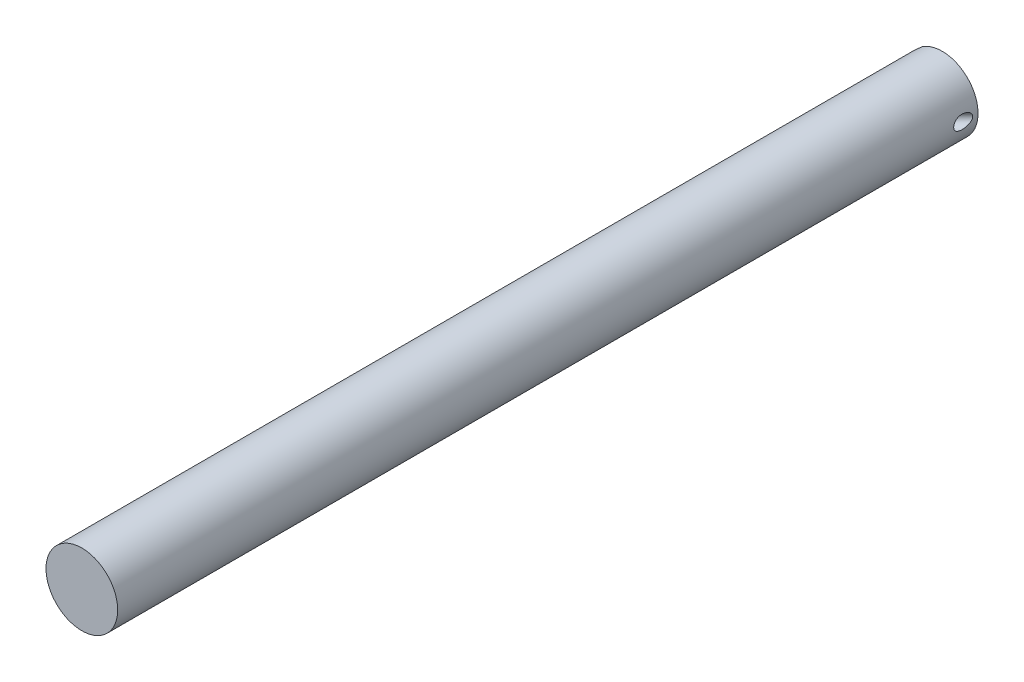
ISO-10303-21;
HEADER;
FILE_DESCRIPTION(('STEP AP214'),'2;1');
FILE_NAME('part.step','',(''),(''),'','','');
FILE_SCHEMA(('AUTOMOTIVE_DESIGN { 1 0 10303 214 1 1 1 1 }'));
ENDSEC;
DATA;
#1=APPLICATION_CONTEXT('core data for automotive mechanical design processes');
#2=APPLICATION_PROTOCOL_DEFINITION('international standard','automotive_design',2000,#1);
#3=PRODUCT_CONTEXT('',#1,'mechanical');
#4=PRODUCT('Part','Part','',(#3));
#5=PRODUCT_RELATED_PRODUCT_CATEGORY('part','',(#4));
#6=PRODUCT_DEFINITION_FORMATION('','',#4);
#7=PRODUCT_DEFINITION_CONTEXT('part definition',#1,'design');
#8=PRODUCT_DEFINITION('design','',#6,#7);
#9=PRODUCT_DEFINITION_SHAPE('','',#8);
#10=(LENGTH_UNIT() NAMED_UNIT(*) SI_UNIT(.MILLI.,.METRE.));
#11=(NAMED_UNIT(*) PLANE_ANGLE_UNIT() SI_UNIT($,.RADIAN.));
#12=(NAMED_UNIT(*) SI_UNIT($,.STERADIAN.) SOLID_ANGLE_UNIT());
#13=UNCERTAINTY_MEASURE_WITH_UNIT(LENGTH_MEASURE(1.E-05),#10,'distance_accuracy_value','');
#14=(GEOMETRIC_REPRESENTATION_CONTEXT(3) GLOBAL_UNCERTAINTY_ASSIGNED_CONTEXT((#13)) GLOBAL_UNIT_ASSIGNED_CONTEXT((#10,
#11,#12)) REPRESENTATION_CONTEXT('',''));
#15=CARTESIAN_POINT('',(0.,0.,0.));
#16=DIRECTION('',(0.,0.,1.));
#17=DIRECTION('',(1.,0.,0.));
#18=AXIS2_PLACEMENT_3D('',#15,#16,#17);
#19=CARTESIAN_POINT('',(0.,0.,304.8));
#20=DIRECTION('',(0.,0.,-1.));
#21=DIRECTION('',(-1.,0.,0.));
#22=AXIS2_PLACEMENT_3D('',#19,#20,#21);
#23=CYLINDRICAL_SURFACE('',#22,12.7);
#24=CARTESIAN_POINT('',(0.,0.,0.));
#25=DIRECTION('',(0.,0.,1.));
#26=DIRECTION('',(1.,0.,0.));
#27=AXIS2_PLACEMENT_3D('',#24,#25,#26);
#28=CIRCLE('',#27,12.7);
#29=CARTESIAN_POINT('',(-7.18420489685536,-10.4726882890688,0.));
#30=VERTEX_POINT('',#29);
#31=CARTESIAN_POINT('',(-7.18420489685536,10.4726882890688,0.));
#32=VERTEX_POINT('',#31);
#33=EDGE_CURVE('E88',#30,#32,#28,.T.);
#34=ORIENTED_EDGE('',*,*,#33,.T.);
#35=CARTESIAN_POINT('',(0.,0.,-7.18420489685528));
#36=DIRECTION('',(0.707106781186544,0.,0.707106781186551));
#37=DIRECTION('',(0.707106781186551,0.,-0.707106781186544));
#38=AXIS2_PLACEMENT_3D('',#35,#36,#37);
#39=ELLIPSE('',#38,17.9605122421382,12.7);
#40=EDGE_CURVE('E60',#32,#30,#39,.T.);
#41=ORIENTED_EDGE('',*,*,#40,.T.);
#42=EDGE_LOOP('',(#34,#41));
#43=FACE_BOUND('',#42,.T.);
#44=CARTESIAN_POINT('',(0.,0.,304.8));
#45=DIRECTION('',(0.,0.,1.));
#46=DIRECTION('',(1.,0.,0.));
#47=AXIS2_PLACEMENT_3D('',#44,#45,#46);
#48=CIRCLE('',#47,12.7);
#49=CARTESIAN_POINT('',(12.7,0.,304.8));
#50=VERTEX_POINT('',#49);
#51=EDGE_CURVE('E92',#50,#50,#48,.T.);
#52=ORIENTED_EDGE('',*,*,#51,.F.);
#53=EDGE_LOOP('',(#52));
#54=FACE_BOUND('',#53,.T.);
#55=CARTESIAN_POINT('',(12.6999999999999,0.,8.62810828753938));
#56=CARTESIAN_POINT('',(12.6999971319786,0.11373770875861,8.62809782493057));
#57=CARTESIAN_POINT('',(12.6984533424594,0.227597051934321,8.61804922853281));
#58=CARTESIAN_POINT('',(12.6924572192031,0.451859376601861,8.57835981793551));
#59=CARTESIAN_POINT('',(12.6880002739569,0.562256586692913,8.54868793930862));
#60=CARTESIAN_POINT('',(12.6767232157731,0.77595206320112,8.47145155220222));
#61=CARTESIAN_POINT('',(12.6699122438964,0.879275963714225,8.42395619482205));
#62=CARTESIAN_POINT('',(12.65464619015,1.07692957675169,8.31330233372744));
#63=CARTESIAN_POINT('',(12.6461912635282,1.17126013731601,8.250145308879));
#64=CARTESIAN_POINT('',(12.6279217762611,1.35445497070078,8.10679307221089));
#65=CARTESIAN_POINT('',(12.6180576926895,1.4427212448389,8.02584423501028));
#66=CARTESIAN_POINT('',(12.5982141214559,1.60680917858928,7.85225753823318));
#67=CARTESIAN_POINT('',(12.5882345729188,1.68262392056053,7.75961323126541));
#68=CARTESIAN_POINT('',(12.564379632614,1.85391518139636,7.52023797144256));
#69=CARTESIAN_POINT('',(12.5508405796145,1.94223512952511,7.36832976395672));
#70=CARTESIAN_POINT('',(12.5265412915488,2.0932225095407,7.05203991809518));
#71=CARTESIAN_POINT('',(12.5157871275328,2.15583406821598,6.88763202238021));
#72=CARTESIAN_POINT('',(12.4949858380187,2.27379170051919,6.49717780958616));
#73=CARTESIAN_POINT('',(12.486286818466,2.32027277629726,6.26836176711457));
#74=CARTESIAN_POINT('',(12.4783540608858,2.36236729673578,5.92205933490711));
#75=CARTESIAN_POINT('',(12.4765630934586,2.37179053233315,5.80601260116037));
#76=CARTESIAN_POINT('',(12.4746397922965,2.38188957420452,5.57352034651925));
#77=CARTESIAN_POINT('',(12.4745074457393,2.38256544810185,5.45707482871471));
#78=CARTESIAN_POINT('',(12.4765510581496,2.37188672091498,5.10328515684809));
#79=CARTESIAN_POINT('',(12.4812716377639,2.3472850484156,4.8661931982996));
#80=CARTESIAN_POINT('',(12.4926696922231,2.28551409868691,4.51537740369117));
#81=CARTESIAN_POINT('',(12.4971913911168,2.26076336359933,4.39919455505617));
#82=CARTESIAN_POINT('',(12.5075189213091,2.20291921786871,4.16895264575401));
#83=CARTESIAN_POINT('',(12.5133245832747,2.16982690725828,4.05489330718031));
#84=CARTESIAN_POINT('',(12.5252971230031,2.09953420564742,3.84286254495058));
#85=CARTESIAN_POINT('',(12.5313418923489,2.06327002720987,3.74457249337941));
#86=CARTESIAN_POINT('',(12.5441496128162,1.98391736348096,3.5508392272295));
#87=CARTESIAN_POINT('',(12.5509124359522,1.94083009366337,3.45539550919327));
#88=CARTESIAN_POINT('',(12.5649797336141,1.8475680538975,3.26820627594691));
#89=CARTESIAN_POINT('',(12.5722835134905,1.79740230105187,3.17645624366465));
#90=CARTESIAN_POINT('',(12.5872305418089,1.68955231694368,2.99755949959075));
#91=CARTESIAN_POINT('',(12.5948736195056,1.63187183967576,2.91041051967903));
#92=CARTESIAN_POINT('',(12.612282973033,1.4921539051402,2.71969001084434));
#93=CARTESIAN_POINT('',(12.622077158346,1.40770605782745,2.61785567089207));
#94=CARTESIAN_POINT('',(12.6411207247394,1.22494143421868,2.42738266382474));
#95=CARTESIAN_POINT('',(12.6503708623785,1.12664459538375,2.33872539714301));
#96=CARTESIAN_POINT('',(12.6653928168115,0.940413879692788,2.19868162832541));
#97=CARTESIAN_POINT('',(12.6714720679918,0.85543708276165,2.14342824566134));
#98=CARTESIAN_POINT('',(12.6822200605232,0.67763028865964,2.04721048638576));
#99=CARTESIAN_POINT('',(12.6868907996329,0.584811655591836,2.0062258588535));
#100=CARTESIAN_POINT('',(12.693704962611,0.407952128563969,1.94693396634566));
#101=CARTESIAN_POINT('',(12.6961276710582,0.324776311849415,1.9260985347771));
#102=CARTESIAN_POINT('',(12.6993204256849,0.156072928502487,1.89870322922189));
#103=CARTESIAN_POINT('',(12.7000915074846,0.0705468696422881,1.89213440959908));
#104=CARTESIAN_POINT('',(12.6998909215526,-0.100423457057528,1.89384808465933));
#105=CARTESIAN_POINT('',(12.6989177955728,-0.185867596646691,1.90214300619903));
#106=CARTESIAN_POINT('',(12.6953413338863,-0.354135455727669,1.93286578148665));
#107=CARTESIAN_POINT('',(12.6927369018493,-0.436957373581436,1.95530313981858));
#108=CARTESIAN_POINT('',(12.68541645302,-0.616451360596662,2.01914526276462));
#109=CARTESIAN_POINT('',(12.6803545298389,-0.711979628741783,2.06370683068989));
#110=CARTESIAN_POINT('',(12.6687954330935,-0.894443824488474,2.16769293198898));
#111=CARTESIAN_POINT('',(12.6622958250454,-0.98136481125724,2.22714269893322));
#112=CARTESIAN_POINT('',(12.6454472405234,-1.18183752507321,2.38554533681141));
#113=CARTESIAN_POINT('',(12.634650458576,-1.29061363065493,2.4904544091119));
#114=CARTESIAN_POINT('',(12.6126291456614,-1.49055028216729,2.7158351673014));
#115=CARTESIAN_POINT('',(12.6014037124746,-1.58167090762306,2.83634111687203));
#116=CARTESIAN_POINT('',(12.5821082243437,-1.727582908367,3.05740200648471));
#117=CARTESIAN_POINT('',(12.5739327442248,-1.78582693980838,3.15571481418542));
#118=CARTESIAN_POINT('',(12.5581458663134,-1.89366007951776,3.3570688711909));
#119=CARTESIAN_POINT('',(12.5505347544499,-1.94324481768888,3.46011247505545));
#120=CARTESIAN_POINT('',(12.5361105379724,-2.03422020001439,3.6698967879334));
#121=CARTESIAN_POINT('',(12.5292981571794,-2.07560343493894,3.77664073849419));
#122=CARTESIAN_POINT('',(12.5166732724235,-2.15042486007303,3.99290395193508));
#123=CARTESIAN_POINT('',(12.5108606162105,-2.18386426036287,4.10242278930167));
#124=CARTESIAN_POINT('',(12.5001996345572,-2.2440999189909,4.32780407493152));
#125=CARTESIAN_POINT('',(12.4953964142886,-2.27059501298341,4.4437493404606));
#126=CARTESIAN_POINT('',(12.4871983781956,-2.31524813999111,4.67729276117707));
#127=CARTESIAN_POINT('',(12.4838040532589,-2.33340326742815,4.7948914777304));
#128=CARTESIAN_POINT('',(12.4759531892293,-2.37519012728234,5.14910624452976));
#129=CARTESIAN_POINT('',(12.4738143893912,-2.38622072062735,5.38743217901117));
#130=CARTESIAN_POINT('',(12.4763854262226,-2.37272205113291,5.84433018331078));
#131=CARTESIAN_POINT('',(12.480572126969,-2.3509094999168,6.06298782948127));
#132=CARTESIAN_POINT('',(12.4949601726286,-2.27324297343286,6.49410002881361));
#133=CARTESIAN_POINT('',(12.5051541831602,-2.2174305061866,6.70656181515549));
#134=CARTESIAN_POINT('',(12.5275497654586,-2.08653900798866,7.06588708358759));
#135=CARTESIAN_POINT('',(12.5386086071325,-2.01978955492549,7.21584999611699));
#136=CARTESIAN_POINT('',(12.5628101767019,-1.86335028799411,7.50314832306523));
#137=CARTESIAN_POINT('',(12.5759497941612,-1.77369459460284,7.64050210956843));
#138=CARTESIAN_POINT('',(12.6003149719503,-1.59024501148045,7.87207669135115));
#139=CARTESIAN_POINT('',(12.6114265735178,-1.50051468515135,7.9695244909145));
#140=CARTESIAN_POINT('',(12.6330466488551,-1.3060083831839,8.14850350206588));
#141=CARTESIAN_POINT('',(12.6435550687062,-1.20123106540994,8.23003329229447));
#142=CARTESIAN_POINT('',(12.657975879026,-1.03384487819375,8.33750826463793));
#143=CARTESIAN_POINT('',(12.6625784090404,-0.976036811632408,8.37099053268202));
#144=CARTESIAN_POINT('',(12.6711580170766,-0.857484036324238,8.43234249954731));
#145=CARTESIAN_POINT('',(12.6751354325047,-0.796740935075283,8.46021522841798));
#146=CARTESIAN_POINT('',(12.6823122820457,-0.672900319741484,8.50985213150572));
#147=CARTESIAN_POINT('',(12.6855132210832,-0.609807637883641,8.53162813490825));
#148=CARTESIAN_POINT('',(12.6910210119984,-0.481755608571782,8.56875960359139));
#149=CARTESIAN_POINT('',(12.6933284058164,-0.416797418322317,8.58411896105062));
#150=CARTESIAN_POINT('',(12.696744031434,-0.293330277490591,8.6067408549964));
#151=CARTESIAN_POINT('',(12.6979612286689,-0.234959302821683,8.61474216877285));
#152=CARTESIAN_POINT('',(12.6995899472221,-0.117736413068172,8.62542853963737));
#153=CARTESIAN_POINT('',(12.7000014848374,-0.0588845077361125,8.62811370426157));
#154=CARTESIAN_POINT('',(12.6999999999999,0.,8.62810828753938));
#155=B_SPLINE_CURVE_WITH_KNOTS('',3,(#55,#56,#57,#58,#59,#60,#61,#62,#63,#64,#65,#66,#67,#68,
#69,#70,#71,#72,#73,#74,#75,#76,#77,#78,#79,#80,#81,#82,#83,#84,#85,#86,#87,#88,#89,#90,#91,#92,
#93,#94,#95,#96,#97,#98,#99,#100,#101,#102,#103,#104,#105,#106,#107,#108,#109,#110,#111,#112,
#113,#114,#115,#116,#117,#118,#119,#120,#121,#122,#123,#124,#125,#126,#127,#128,#129,#130,#131,
#132,#133,#134,#135,#136,#137,#138,#139,#140,#141,#142,#143,#144,#145,#146,#147,#148,#149,#150,
#151,#152,#153,#154),.UNSPECIFIED.,.T.,.F.,(4,2,2,2,2,2,2,2,2,2,2,2,2,2,2,2,2,2,2,2,2,2,2,2,2,2,
2,2,2,2,2,2,2,2,2,2,2,2,2,2,2,2,2,2,2,2,2,2,2,4),(0.,0.340982101289508,0.682505286885447,
1.02271691279504,1.36289642616282,1.72204239164007,2.0813872161511,2.60716302187791,
3.1340755476759,3.8310266469869,4.18009359414622,4.52915784276849,5.24136197552939,
5.59776454017972,5.95412012934897,6.26870499131254,6.58323387566025,6.89736564733162,
7.21134109132501,7.6081933889894,8.00448009463064,8.30803936588512,8.61116603755278,
8.86737394599905,9.12342115720076,9.37968253700636,9.63611632406049,9.95097647332464,
10.2663739247878,10.7184033085812,11.1714431363144,11.5146944093723,11.8581184140164,
12.2018512673263,12.5455317263613,12.9022884468352,13.2591693644314,13.9720342060903,
14.6290816834805,15.2853286225144,15.777171010911,16.2682849935492,16.6655650116392,
17.0628804876624,17.2635175585478,17.4640459606766,17.6641825473204,17.8641975591802,
18.0407350467557,18.2172689632589),.UNSPECIFIED.);
#156=CARTESIAN_POINT('',(12.6999999999999,0.,8.62810828753938));
#157=VERTEX_POINT('',#156);
#158=EDGE_CURVE('E95',#157,#157,#155,.T.);
#159=ORIENTED_EDGE('',*,*,#158,.T.);
#160=EDGE_LOOP('',(#159));
#161=FACE_BOUND('',#160,.T.);
#162=CARTESIAN_POINT('',(-12.2403337367663,-3.38588688715096,27.272793195938));
#163=CARTESIAN_POINT('',(-12.2196674640612,-3.46045383977976,27.4246129192115));
#164=CARTESIAN_POINT('',(-12.2005542629207,-3.5270399628867,27.5803870391927));
#165=CARTESIAN_POINT('',(-12.1658428331486,-3.64503725053378,27.8976240342367));
#166=CARTESIAN_POINT('',(-12.1502376584458,-3.69647846646983,28.0590749223147));
#167=CARTESIAN_POINT('',(-12.1229979211142,-3.78483398918307,28.3844860786729));
#168=CARTESIAN_POINT('',(-12.1113264183075,-3.82188397417107,28.5484069786533));
#169=CARTESIAN_POINT('',(-12.0918255367561,-3.88314266112652,28.8789302680043));
#170=CARTESIAN_POINT('',(-12.0839985940945,-3.90734322191479,29.0455342886544));
#171=CARTESIAN_POINT('',(-12.070591055056,-3.94859923553227,29.4243723959408));
#172=CARTESIAN_POINT('',(-12.0661496186444,-3.962079767576,29.6370370837985));
#173=CARTESIAN_POINT('',(-12.0630336691128,-3.97155205342014,30.0627641229087));
#174=CARTESIAN_POINT('',(-12.0643599514162,-3.96754139501873,30.2758265249595));
#175=CARTESIAN_POINT('',(-12.0723230222069,-3.94324459630414,30.7020677671573));
#176=CARTESIAN_POINT('',(-12.0789888349864,-3.92286950158092,30.9152408627159));
#177=CARTESIAN_POINT('',(-12.0971012444487,-3.86665349270027,31.3392970585468));
#178=CARTESIAN_POINT('',(-12.108547513485,-3.8308136384728,31.5501803147457));
#179=CARTESIAN_POINT('',(-12.1359514784251,-3.74310675130942,31.9738099159133));
#180=CARTESIAN_POINT('',(-12.15201477246,-3.69086156031925,32.1864711101465));
#181=CARTESIAN_POINT('',(-12.1878426214733,-3.57077338346765,32.6070841946828));
#182=CARTESIAN_POINT('',(-12.2076080238936,-3.50292682551849,32.8150349944979));
#183=CARTESIAN_POINT('',(-12.2500391065676,-3.3515240523671,33.2240976616958));
#184=CARTESIAN_POINT('',(-12.272695296209,-3.26801884188796,33.4252292975753));
#185=CARTESIAN_POINT('',(-12.3201391132865,-3.08434258980398,33.8193666302832));
#186=CARTESIAN_POINT('',(-12.3449253684436,-2.98418223982997,34.0123774412453));
#187=CARTESIAN_POINT('',(-12.3980189724521,-2.75574975011194,34.4049523657996));
#188=CARTESIAN_POINT('',(-12.4264411912347,-2.62574595472135,34.6035060494497));
#189=CARTESIAN_POINT('',(-12.4831277701999,-2.34148407038805,34.9827178291624));
#190=CARTESIAN_POINT('',(-12.511392213359,-2.18724028449238,35.1633863767027));
#191=CARTESIAN_POINT('',(-12.5596861882094,-1.88735979672359,35.4623331021216));
#192=CARTESIAN_POINT('',(-12.5801852728702,-1.7469198996464,35.5856954068001));
#193=CARTESIAN_POINT('',(-12.6180516645094,-1.44821009376826,35.8092704692864));
#194=CARTESIAN_POINT('',(-12.6354249828796,-1.28997538137487,35.9095277686972));
#195=CARTESIAN_POINT('',(-12.6611856771506,-0.999866166719827,36.05636818832));
#196=CARTESIAN_POINT('',(-12.670734995173,-0.871756378728673,36.1101268382262));
#197=CARTESIAN_POINT('',(-12.6861077342991,-0.608286503909871,36.1961926184825));
#198=CARTESIAN_POINT('',(-12.6919351164275,-0.472934291620871,36.2285225554656));
#199=CARTESIAN_POINT('',(-12.6992116176179,-0.197638431206163,36.2688387664231));
#200=CARTESIAN_POINT('',(-12.7006349342529,-0.0576725619284679,36.2766815782641));
#201=CARTESIAN_POINT('',(-12.698837869953,0.221322407617087,36.266749816781));
#202=CARTESIAN_POINT('',(-12.6956167786139,0.360351361307044,36.2489713244468));
#203=CARTESIAN_POINT('',(-12.6853813534612,0.622014551870811,36.1920796460861));
#204=CARTESIAN_POINT('',(-12.6786913727207,0.745070201837775,36.1547885818711));
#205=CARTESIAN_POINT('',(-12.6623688244859,0.984284620875061,36.0629556568689));
#206=CARTESIAN_POINT('',(-12.6527350124251,1.10044044804524,36.0084064995152));
#207=CARTESIAN_POINT('',(-12.6253152978752,1.3863292416289,35.8512569855426));
#208=CARTESIAN_POINT('',(-12.6059585675664,1.55043522620581,35.7387227175428));
#209=CARTESIAN_POINT('',(-12.5641963102671,1.85886151068497,35.489576832926));
#210=CARTESIAN_POINT('',(-12.541782253019,2.00312409963314,35.3528975225902));
#211=CARTESIAN_POINT('',(-12.5002638916159,2.24619252913592,35.09154924176));
#212=CARTESIAN_POINT('',(-12.4813866050456,2.34833548704604,34.969888035629));
#213=CARTESIAN_POINT('',(-12.4434560993321,2.54167639311338,34.7181157816671));
#214=CARTESIAN_POINT('',(-12.4244027809319,2.63286770186149,34.5879996809974));
#215=CARTESIAN_POINT('',(-12.3866242982712,2.80523263531999,34.32096707141));
#216=CARTESIAN_POINT('',(-12.3678997653273,2.88638848395421,34.1840390812192));
#217=CARTESIAN_POINT('',(-12.3312411991662,3.0391862240107,33.9049242134936));
#218=CARTESIAN_POINT('',(-12.3133070945709,3.11082897567643,33.7627378129513));
#219=CARTESIAN_POINT('',(-12.2704074924496,3.27682075494684,33.4060309997327));
#220=CARTESIAN_POINT('',(-12.2461105179309,3.36596301442228,33.1889952188452));
#221=CARTESIAN_POINT('',(-12.2010052577643,3.52595473603677,32.7478748732219));
#222=CARTESIAN_POINT('',(-12.1801986842802,3.59679522966739,32.5237869127793));
#223=CARTESIAN_POINT('',(-12.1429636824796,3.72056580267409,32.0701433298728));
#224=CARTESIAN_POINT('',(-12.1265392815498,3.77347941851904,31.8405828875709));
#225=CARTESIAN_POINT('',(-12.0989461144652,3.86103807380721,31.3777502019756));
#226=CARTESIAN_POINT('',(-12.0877755644162,3.89568931454628,31.1444792464037));
#227=CARTESIAN_POINT('',(-12.0729244437518,3.94144045292059,30.7172061518791));
#228=CARTESIAN_POINT('',(-12.0682677871568,3.95562437662479,30.5235655228665));
#229=CARTESIAN_POINT('',(-12.0634542828972,3.97028187681669,30.1356730956172));
#230=CARTESIAN_POINT('',(-12.0632976462805,3.97075481026838,29.9414212691432));
#231=CARTESIAN_POINT('',(-12.0678204683504,3.95699004287311,29.5543612382292));
#232=CARTESIAN_POINT('',(-12.0724774526623,3.94282070558345,29.3615505204009));
#233=CARTESIAN_POINT('',(-12.0868107452287,3.89865834994165,28.9780080331273));
#234=CARTESIAN_POINT('',(-12.096485020209,3.86867174150876,28.7872754534546));
#235=CARTESIAN_POINT('',(-12.1235048295729,3.78326883134902,28.3695569823566));
#236=CARTESIAN_POINT('',(-12.142039540388,3.72381745098503,28.1434286817473));
#237=CARTESIAN_POINT('',(-12.1751042376723,3.61362397901262,27.8111686010879));
#238=CARTESIAN_POINT('',(-12.1870436683142,3.57324770393538,27.701273632933));
#239=CARTESIAN_POINT('',(-12.2125265831856,3.48514952825051,27.4845504630117));
#240=CARTESIAN_POINT('',(-12.2260714862738,3.43742111876324,27.3777250791751));
#241=CARTESIAN_POINT('',(-12.2403337367663,3.38588688715095,27.272793195938));
#242=B_SPLINE_CURVE_WITH_KNOTS('',3,(#162,#163,#164,#165,#166,#167,#168,#169,#170,#171,#172,
#173,#174,#175,#176,#177,#178,#179,#180,#181,#182,#183,#184,#185,#186,#187,#188,#189,#190,#191,
#192,#193,#194,#195,#196,#197,#198,#199,#200,#201,#202,#203,#204,#205,#206,#207,#208,#209,#210,
#211,#212,#213,#214,#215,#216,#217,#218,#219,#220,#221,#222,#223,#224,#225,#226,#227,#228,#229,
#230,#231,#232,#233,#234,#235,#236,#237,#238,#239,#240,#241),.UNSPECIFIED.,.F.,.F.,(4,2,2,2,2,2,
2,2,2,2,2,2,2,2,2,2,2,2,2,2,2,2,2,2,2,2,2,2,2,2,2,2,2,2,2,2,2,2,2,4),(0.,0.51073731285378,
1.02045425337734,1.52524173346847,2.03034865792681,2.66885273586861,3.30744487239062,
3.94953197771204,4.59157508239482,5.24966378464755,5.90790331312808,6.5640348820737,
7.21974686733952,7.9353223441827,8.65047716307784,9.21290098946326,9.77423133773144,
10.190404867565,10.606134748574,11.0242957294297,11.4425206785777,11.8272605814075,
12.2121633666743,12.8085408138551,13.4066176144639,13.8858864064636,14.3654443026852,
14.8458398411224,15.3261919090723,16.0328769235741,16.7399075845115,17.4475858131283,
18.1550235826497,18.7371804631269,19.3193646463174,19.8988428870554,20.4780864755429,
21.1797522631259,21.5325605730077,21.885683040165),.UNSPECIFIED.);
#243=CARTESIAN_POINT('',(-12.2403337367662,-3.38588688715103,27.2727931959381));
#244=VERTEX_POINT('',#243);
#245=CARTESIAN_POINT('',(-12.2403337367662,3.38588688715103,27.2727931959381));
#246=VERTEX_POINT('',#245);
#247=EDGE_CURVE('E11',#244,#246,#242,.T.);
#248=ORIENTED_EDGE('',*,*,#247,.F.);
#249=CARTESIAN_POINT('',(0.,0.,39.5131269327044));
#250=DIRECTION('',(-0.707106781186549,0.,0.707106781186546));
#251=DIRECTION('',(-0.707106781186546,0.,-0.707106781186549));
#252=AXIS2_PLACEMENT_3D('',#249,#250,#251);
#253=ELLIPSE('',#252,17.9605122421383,12.7);
#254=EDGE_CURVE('E66',#246,#244,#253,.T.);
#255=ORIENTED_EDGE('',*,*,#254,.F.);
#256=EDGE_LOOP('',(#248,#255));
#257=FACE_BOUND('',#256,.T.);
#258=ADVANCED_FACE('F36',(#43,#54,#161,#257),#23,.T.);
#259=CARTESIAN_POINT('',(15.3302561210692,0.,2.63025612106917));
#260=DIRECTION('',(-0.707106781186549,0.,0.707106781186546));
#261=DIRECTION('',(0.707106781186546,0.,0.707106781186549));
#262=AXIS2_PLACEMENT_3D('',#259,#260,#261);
#263=CYLINDRICAL_SURFACE('',#262,2.38125);
#264=ORIENTED_EDGE('',*,*,#158,.F.);
#265=EDGE_LOOP('',(#264));
#266=FACE_BOUND('',#265,.T.);
#267=CARTESIAN_POINT('',(-0.292023768205474,-0.244294465377066,14.9027086187649));
#268=CARTESIAN_POINT('',(-0.298461796018081,-0.155887806708231,14.8962611938073));
#269=CARTESIAN_POINT('',(-0.296992607075424,-0.0668434670892464,14.8889381844429));
#270=CARTESIAN_POINT('',(-0.27828403830796,0.109480680759207,14.8724407586452));
#271=CARTESIAN_POINT('',(-0.26101556181855,0.196756929567133,14.8632629506382));
#272=CARTESIAN_POINT('',(-0.21211130128671,0.366456072067372,14.8429593452588));
#273=CARTESIAN_POINT('',(-0.180542928825595,0.448899710752939,14.8318428367069));
#274=CARTESIAN_POINT('',(-0.105087227781106,0.607503803870428,14.8074047261888));
#275=CARTESIAN_POINT('',(-0.0612000678396677,0.683664344298344,14.7940831544106));
#276=CARTESIAN_POINT('',(0.0399047903847246,0.833415261841485,14.7638961525813));
#277=CARTESIAN_POINT('',(0.0978136419770546,0.906500032149971,14.7468542623679));
#278=CARTESIAN_POINT('',(0.2225400738336,1.04360415617815,14.7091440293673));
#279=CARTESIAN_POINT('',(0.289366366953336,1.10761451589704,14.6884721335336));
#280=CARTESIAN_POINT('',(0.443300765150437,1.23773279259971,14.6379868698587));
#281=CARTESIAN_POINT('',(0.531817110255122,1.3017936012977,14.6071759408584));
#282=CARTESIAN_POINT('',(0.714346717369121,1.41550483955697,14.5363746655978));
#283=CARTESIAN_POINT('',(0.808359034322201,1.46515773791521,14.4963858940673));
#284=CARTESIAN_POINT('',(0.976129488081728,1.53920911196737,14.4141907486043));
#285=CARTESIAN_POINT('',(1.0497050853587,1.5667735123595,14.3744897243833));
#286=CARTESIAN_POINT('',(1.1945083288971,1.61120418888701,14.2859752752582));
#287=CARTESIAN_POINT('',(1.26574052914445,1.62809253860886,14.2371809239664));
#288=CARTESIAN_POINT('',(1.40320139348408,1.65020237380352,14.1293742159741));
#289=CARTESIAN_POINT('',(1.46937970618074,1.65531834760956,14.0702745193536));
#290=CARTESIAN_POINT('',(1.59292612961127,1.65309172449041,13.9436883985586));
#291=CARTESIAN_POINT('',(1.65029324583758,1.64574772235024,13.8762010292322));
#292=CARTESIAN_POINT('',(1.74882639284133,1.62085487729614,13.7445356993949));
#293=CARTESIAN_POINT('',(1.79110848812642,1.60462681779579,13.6809221804476));
#294=CARTESIAN_POINT('',(1.86857156474765,1.56384247071792,13.5520609637635));
#295=CARTESIAN_POINT('',(1.90374543032616,1.53927790304953,13.4868117012588));
#296=CARTESIAN_POINT('',(1.98400799937959,1.46850842671502,13.3244013785134));
#297=CARTESIAN_POINT('',(2.02537789801493,1.41761136364474,13.2274424063798));
#298=CARTESIAN_POINT('',(2.09842903238935,1.30044483769678,13.0392097505566));
#299=CARTESIAN_POINT('',(2.13009055112805,1.23414456549934,12.9479479326586));
#300=CARTESIAN_POINT('',(2.18681659353028,1.08606121937702,12.774323982155));
#301=CARTESIAN_POINT('',(2.21178955570441,1.00408724026726,12.692093652118));
#302=CARTESIAN_POINT('',(2.25641165338015,0.826198443702361,12.5427780728046));
#303=CARTESIAN_POINT('',(2.27607283270849,0.730315934546634,12.4756586200752));
#304=CARTESIAN_POINT('',(2.30699327331947,0.551064864396961,12.3753728381132));
#305=CARTESIAN_POINT('',(2.31913560572315,0.470244685586219,12.3379223961993));
#306=CARTESIAN_POINT('',(2.34131116885004,0.30323905412205,12.276885352926));
#307=CARTESIAN_POINT('',(2.35134593341655,0.217057562943557,12.2532886464981));
#308=CARTESIAN_POINT('',(2.36953173105492,0.0412892292195644,12.2215829710814));
#309=CARTESIAN_POINT('',(2.37767479739547,-0.0483102290141936,12.2135384945943));
#310=CARTESIAN_POINT('',(2.39214634591816,-0.227634103658757,12.2137878433396));
#311=CARTESIAN_POINT('',(2.3984748677632,-0.317358517295162,12.2220813114208));
#312=CARTESIAN_POINT('',(2.40905695413042,-0.488220886213076,12.2532669648123));
#313=CARTESIAN_POINT('',(2.41341902293885,-0.569536956891114,12.2751705531022));
#314=CARTESIAN_POINT('',(2.42070988743394,-0.727845060351188,12.3312611247136));
#315=CARTESIAN_POINT('',(2.42363839420421,-0.804836218736038,12.3654505816919));
#316=CARTESIAN_POINT('',(2.42828079196225,-0.959345751369267,12.4475997738512));
#317=CARTESIAN_POINT('',(2.42987462374228,-1.03638416446239,12.4964624778712));
#318=CARTESIAN_POINT('',(2.43138886854596,-1.18306872920343,12.6041987286963));
#319=CARTESIAN_POINT('',(2.43130825550256,-1.25271032195485,12.6630783917819));
#320=CARTESIAN_POINT('',(2.42882182587915,-1.41922602200235,12.8221735899197));
#321=CARTESIAN_POINT('',(2.42520741291167,-1.51099426069188,12.9277683387905));
#322=CARTESIAN_POINT('',(2.41557368787256,-1.6352598378542,13.0956887471319));
#323=CARTESIAN_POINT('',(2.41164914603237,-1.67451122515077,13.1533668468816));
#324=CARTESIAN_POINT('',(2.40201127201347,-1.74861250377657,13.2713419497408));
#325=CARTESIAN_POINT('',(2.3962980910152,-1.78346276675102,13.3316387311416));
#326=CARTESIAN_POINT('',(2.37801724949204,-1.87077708209995,13.4955683718111));
#327=CARTESIAN_POINT('',(2.36342287603818,-1.91935699692011,13.6011162199619));
#328=CARTESIAN_POINT('',(2.33343158616389,-1.98277846580691,13.761419913689));
#329=CARTESIAN_POINT('',(2.32210267136242,-2.00232669118038,13.8151202246858));
#330=CARTESIAN_POINT('',(2.29571919263162,-2.03814021058967,13.9226838259007));
#331=CARTESIAN_POINT('',(2.28066821383507,-2.05440863655151,13.9765469103056));
#332=CARTESIAN_POINT('',(2.24602000826658,-2.08289583706301,14.0818880460567));
#333=CARTESIAN_POINT('',(2.22658516285853,-2.09522835299635,14.1333869718294));
#334=CARTESIAN_POINT('',(2.18133880320301,-2.11602466795943,14.2343187420092));
#335=CARTESIAN_POINT('',(2.15553905308184,-2.12449552307442,14.2837552035385));
#336=CARTESIAN_POINT('',(2.09559625101534,-2.13702005435337,14.3791781568709));
#337=CARTESIAN_POINT('',(2.06132850051958,-2.1410022504938,14.4250982533352));
#338=CARTESIAN_POINT('',(1.98470519763531,-2.14376636936663,14.5097686890375));
#339=CARTESIAN_POINT('',(1.94235901864434,-2.14255428437681,14.5485272362132));
#340=CARTESIAN_POINT('',(1.85893164650034,-2.13571756237707,14.6122191961519));
#341=CARTESIAN_POINT('',(1.81869437616989,-2.1308150684521,14.6383676210449));
#342=CARTESIAN_POINT('',(1.7356372380321,-2.11785811984192,14.6852404983028));
#343=CARTESIAN_POINT('',(1.69281346005288,-2.10979878652584,14.7059564721419));
#344=CARTESIAN_POINT('',(1.56589288402134,-2.08224817081128,14.7599717477043));
#345=CARTESIAN_POINT('',(1.48010322788828,-2.05906384014342,14.7872917542414));
#346=CARTESIAN_POINT('',(1.3085406063095,-2.00427489886727,14.8320603167413));
#347=CARTESIAN_POINT('',(1.22276958222085,-1.97263154713964,14.849462270974));
#348=CARTESIAN_POINT('',(1.06927264570893,-1.90816088149951,14.8754241809445));
#349=CARTESIAN_POINT('',(1.00116347913634,-1.87665393235168,14.8850276962068));
#350=CARTESIAN_POINT('',(0.867180884105858,-1.8085269244625,14.9013077772196));
#351=CARTESIAN_POINT('',(0.801308767018145,-1.77190392885579,14.9079826526066));
#352=CARTESIAN_POINT('',(0.608307458484968,-1.65442175655201,14.9247729308195));
#353=CARTESIAN_POINT('',(0.485412777714056,-1.56579306205551,14.9317075577671));
#354=CARTESIAN_POINT('',(0.286845255965936,-1.39279622378996,14.9389617808291));
#355=CARTESIAN_POINT('',(0.207120331266645,-1.31310010487393,14.9405169384612));
#356=CARTESIAN_POINT('',(0.061186801692315,-1.14207591178356,14.9409757419084));
#357=CARTESIAN_POINT('',(-0.00503863676943872,-1.05076255783697,14.9398827121607));
#358=CARTESIAN_POINT('',(-0.108967352145036,-0.875914361447655,14.9356492176301));
#359=CARTESIAN_POINT('',(-0.149695405963951,-0.79416909811995,14.9329345701241));
#360=CARTESIAN_POINT('',(-0.217153574330685,-0.625248118097912,14.9258392270317));
#361=CARTESIAN_POINT('',(-0.243920055007927,-0.538087178041661,14.9214629116033));
#362=CARTESIAN_POINT('',(-0.269990891156626,-0.415580719808684,14.9142280850374));
#363=CARTESIAN_POINT('',(-0.276040382139219,-0.381538818544294,14.9121055435714));
#364=CARTESIAN_POINT('',(-0.285802248113868,-0.313128471437511,14.9076026194229));
#365=CARTESIAN_POINT('',(-0.289513893898614,-0.278759927100252,14.9052221565621));
#366=CARTESIAN_POINT('',(-0.292023768205474,-0.244294465377066,14.9027086187649));
#367=B_SPLINE_CURVE_WITH_KNOTS('',3,(#267,#268,#269,#270,#271,#272,#273,#274,#275,#276,#277,
#278,#279,#280,#281,#282,#283,#284,#285,#286,#287,#288,#289,#290,#291,#292,#293,#294,#295,#296,
#297,#298,#299,#300,#301,#302,#303,#304,#305,#306,#307,#308,#309,#310,#311,#312,#313,#314,#315,
#316,#317,#318,#319,#320,#321,#322,#323,#324,#325,#326,#327,#328,#329,#330,#331,#332,#333,#334,
#335,#336,#337,#338,#339,#340,#341,#342,#343,#344,#345,#346,#347,#348,#349,#350,#351,#352,#353,
#354,#355,#356,#357,#358,#359,#360,#361,#362,#363,#364,#365,#366),.UNSPECIFIED.,.T.,.F.,(4,2,2,
2,2,2,2,2,2,2,2,2,2,2,2,2,2,2,2,2,2,2,2,2,2,2,2,2,2,2,2,2,2,2,2,2,2,2,2,2,2,2,2,2,2,2,2,2,2,4),
(0.,0.266478521474546,0.53344879155511,0.799173419467982,1.06489440983695,1.34824165288346,
1.63186779780045,1.97107489145607,2.31022382757165,2.57336752510162,2.83596535707569,
3.10090774468829,3.36588001404105,3.59926718749962,3.83288685043003,4.1822248719799,
4.53226774448022,4.88688238582205,5.24068610155834,5.50927257031628,5.77766288494056,
6.04716380205307,6.31665882787949,6.56855691649598,6.82050575112568,7.09322867849221,
7.36611873006494,7.7835043824158,7.99298043628921,8.20243878947985,8.55252967228811,
8.72716318414372,8.90162913782017,9.07046505742357,9.23899122864153,9.41016478409614,
9.58114092181846,9.72529179401765,9.86966632386908,10.1469894814528,10.4256051703516,
10.6522820179253,10.8790895281399,11.3314738646927,11.6685512095348,12.0052056191555,
12.2782586235954,12.5505968015873,12.65445145477,12.7583384856818),.UNSPECIFIED.);
#368=CARTESIAN_POINT('',(-0.292023768205474,-0.244294465377066,14.9027086187649));
#369=VERTEX_POINT('',#368);
#370=EDGE_CURVE('E98',#369,#369,#367,.T.);
#371=ORIENTED_EDGE('',*,*,#370,.T.);
#372=EDGE_LOOP('',(#371));
#373=FACE_BOUND('',#372,.T.);
#374=CARTESIAN_POINT('',(-10.776307345283,0.,28.7368195874213));
#375=DIRECTION('',(-0.707106781186549,0.,0.707106781186546));
#376=DIRECTION('',(0.707106781186546,0.,0.707106781186549));
#377=AXIS2_PLACEMENT_3D('',#374,#375,#376);
#378=CIRCLE('',#377,2.38125);
#379=CARTESIAN_POINT('',(-9.09250932258258,0.,30.4206176101218));
#380=VERTEX_POINT('',#379);
#381=EDGE_CURVE('E71',#380,#380,#378,.F.);
#382=ORIENTED_EDGE('',*,*,#381,.F.);
#383=EDGE_LOOP('',(#382));
#384=FACE_BOUND('',#383,.T.);
#385=ADVANCED_FACE('F77',(#266,#373,#384),#263,.F.);
#386=CARTESIAN_POINT('',(-14.3761772569918,18.6651796988571,7.19197236013632));
#387=DIRECTION('',(0.707106781186544,0.,0.707106781186551));
#388=DIRECTION('',(0.707106781186551,0.,-0.707106781186544));
#389=AXIS2_PLACEMENT_3D('',#386,#387,#388);
#390=PLANE('',#389);
#391=DIRECTION('',(0.,1.,0.));
#392=VECTOR('',#391,1.);
#393=CARTESIAN_POINT('',(-7.18420489685536,0.,0.));
#394=LINE('',#393,#392);
#395=EDGE_CURVE('E48',#30,#32,#394,.T.);
#396=ORIENTED_EDGE('',*,*,#395,.F.);
#397=ORIENTED_EDGE('',*,*,#40,.F.);
#398=EDGE_LOOP('',(#396,#397));
#399=FACE_BOUND('',#398,.T.);
#400=CARTESIAN_POINT('',(-9.84692035181298,-0.244294465377066,2.66271545495758));
#401=DIRECTION('',(-0.707106781186544,0.,-0.707106781186551));
#402=DIRECTION('',(-0.707106781186551,0.,0.707106781186544));
#403=AXIS2_PLACEMENT_3D('',#400,#401,#402);
#404=CIRCLE('',#403,1.89864999999999);
#405=CARTESIAN_POINT('',(-11.1894686419128,-0.244294465377066,4.0052637450574));
#406=VERTEX_POINT('',#405);
#407=EDGE_CURVE('E70',#406,#406,#404,.T.);
#408=ORIENTED_EDGE('',*,*,#407,.F.);
#409=EDGE_LOOP('',(#408));
#410=FACE_BOUND('',#409,.T.);
#411=ADVANCED_FACE('F82',(#399,#410),#390,.F.);
#412=CARTESIAN_POINT('',(0.,0.,304.8));
#413=DIRECTION('',(0.,0.,1.));
#414=DIRECTION('',(1.,0.,0.));
#415=AXIS2_PLACEMENT_3D('',#412,#413,#414);
#416=PLANE('',#415);
#417=ORIENTED_EDGE('',*,*,#51,.T.);
#418=EDGE_LOOP('',(#417));
#419=FACE_BOUND('',#418,.T.);
#420=ADVANCED_FACE('F108',(#419),#416,.T.);
#421=CARTESIAN_POINT('',(0.,0.,0.));
#422=DIRECTION('',(0.,0.,1.));
#423=DIRECTION('',(1.,0.,0.));
#424=AXIS2_PLACEMENT_3D('',#421,#422,#423);
#425=PLANE('',#424);
#426=ORIENTED_EDGE('',*,*,#33,.F.);
#427=ORIENTED_EDGE('',*,*,#395,.T.);
#428=EDGE_LOOP('',(#426,#427));
#429=FACE_BOUND('',#428,.T.);
#430=ADVANCED_FACE('F110',(#429),#425,.F.);
#431=CARTESIAN_POINT('',(-9.84692035181297,-0.244294465377066,2.66271545495758));
#432=DIRECTION('',(-0.707106781186544,0.,-0.707106781186551));
#433=DIRECTION('',(-0.707106781186551,0.,0.707106781186544));
#434=AXIS2_PLACEMENT_3D('',#431,#432,#433);
#435=CYLINDRICAL_SURFACE('',#434,1.89864999999999);
#436=ORIENTED_EDGE('',*,*,#370,.F.);
#437=EDGE_LOOP('',(#436));
#438=FACE_BOUND('',#437,.T.);
#439=ORIENTED_EDGE('',*,*,#407,.T.);
#440=EDGE_LOOP('',(#439));
#441=FACE_BOUND('',#440,.T.);
#442=ADVANCED_FACE('F113',(#438,#441),#435,.F.);
#443=CARTESIAN_POINT('',(-149.769743878931,0.,167.730256121069));
#444=DIRECTION('',(0.707106781186549,0.,-0.707106781186546));
#445=DIRECTION('',(-0.707106781186546,0.,-0.707106781186549));
#446=AXIS2_PLACEMENT_3D('',#443,#444,#445);
#447=CYLINDRICAL_SURFACE('',#446,3.96875);
#448=ORIENTED_EDGE('',*,*,#247,.T.);
#449=CARTESIAN_POINT('',(-10.776307345283,0.,28.7368195874213));
#450=DIRECTION('',(-0.707106781186549,0.,0.707106781186546));
#451=DIRECTION('',(0.707106781186546,0.,0.707106781186549));
#452=AXIS2_PLACEMENT_3D('',#449,#450,#451);
#453=CIRCLE('',#452,3.96875);
#454=EDGE_CURVE('E54',#244,#246,#453,.T.);
#455=ORIENTED_EDGE('',*,*,#454,.F.);
#456=EDGE_LOOP('',(#448,#455));
#457=FACE_BOUND('',#456,.T.);
#458=ADVANCED_FACE('F74',(#457),#447,.F.);
#459=CARTESIAN_POINT('',(-10.776307345283,0.,28.7368195874213));
#460=DIRECTION('',(-0.707106781186549,0.,0.707106781186546));
#461=DIRECTION('',(0.707106781186546,0.,0.707106781186549));
#462=AXIS2_PLACEMENT_3D('',#459,#460,#461);
#463=PLANE('',#462);
#464=ORIENTED_EDGE('',*,*,#381,.T.);
#465=EDGE_LOOP('',(#464));
#466=FACE_BOUND('',#465,.T.);
#467=ORIENTED_EDGE('',*,*,#254,.T.);
#468=ORIENTED_EDGE('',*,*,#454,.T.);
#469=EDGE_LOOP('',(#467,#468));
#470=FACE_BOUND('',#469,.T.);
#471=ADVANCED_FACE('F67',(#466,#470),#463,.T.);
#472=CLOSED_SHELL('',(#258,#385,#411,#420,#430,#442,#458,#471));
#473=MANIFOLD_SOLID_BREP('B2',#472);
#474=ADVANCED_BREP_SHAPE_REPRESENTATION('',(#18,#473),#14);
#475=SHAPE_DEFINITION_REPRESENTATION(#9,#474);
ENDSEC;
END-ISO-10303-21;
